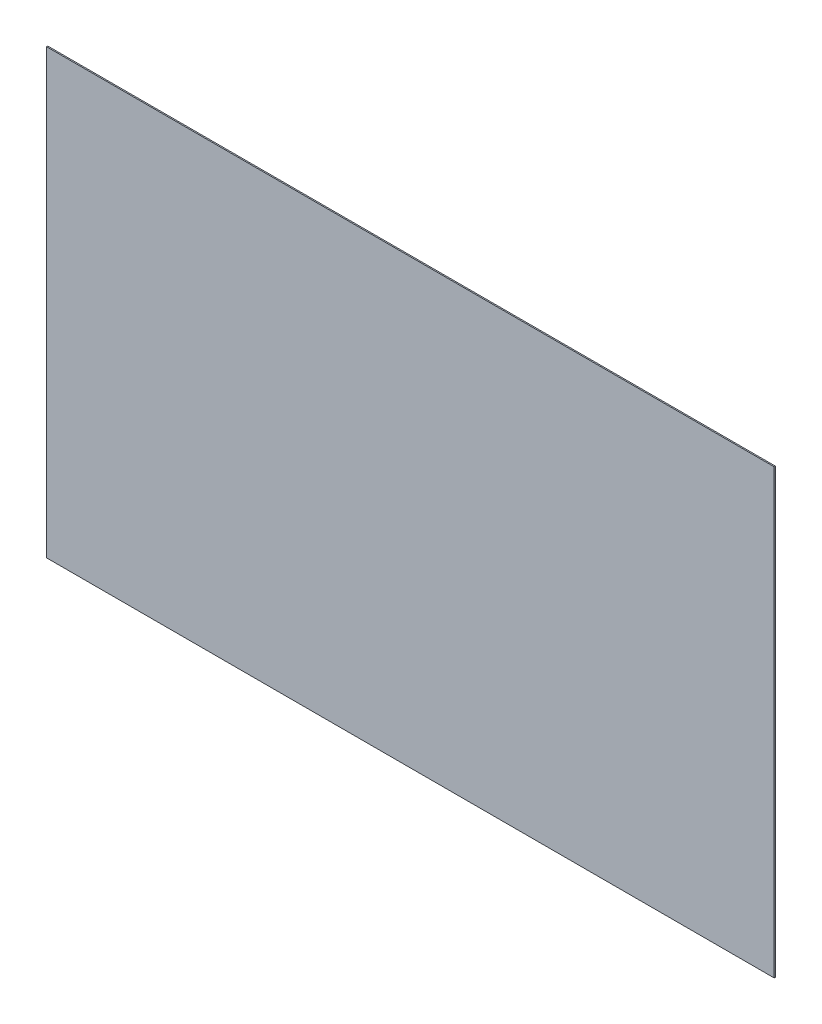
ISO-10303-21;
HEADER;
FILE_DESCRIPTION(('STEP AP214'),'2;1');
FILE_NAME('part.step','',(''),(''),'','','');
FILE_SCHEMA(('AUTOMOTIVE_DESIGN { 1 0 10303 214 1 1 1 1 }'));
ENDSEC;
DATA;
#1=APPLICATION_CONTEXT('core data for automotive mechanical design processes');
#2=APPLICATION_PROTOCOL_DEFINITION('international standard','automotive_design',2000,#1);
#3=PRODUCT_CONTEXT('',#1,'mechanical');
#4=PRODUCT('Part','Part','',(#3));
#5=PRODUCT_RELATED_PRODUCT_CATEGORY('part','',(#4));
#6=PRODUCT_DEFINITION_FORMATION('','',#4);
#7=PRODUCT_DEFINITION_CONTEXT('part definition',#1,'design');
#8=PRODUCT_DEFINITION('design','',#6,#7);
#9=PRODUCT_DEFINITION_SHAPE('','',#8);
#10=(LENGTH_UNIT() NAMED_UNIT(*) SI_UNIT(.MILLI.,.METRE.));
#11=(NAMED_UNIT(*) PLANE_ANGLE_UNIT() SI_UNIT($,.RADIAN.));
#12=(NAMED_UNIT(*) SI_UNIT($,.STERADIAN.) SOLID_ANGLE_UNIT());
#13=UNCERTAINTY_MEASURE_WITH_UNIT(LENGTH_MEASURE(1.E-05),#10,'distance_accuracy_value','');
#14=(GEOMETRIC_REPRESENTATION_CONTEXT(3) GLOBAL_UNCERTAINTY_ASSIGNED_CONTEXT((#13)) GLOBAL_UNIT_ASSIGNED_CONTEXT((#10,
#11,#12)) REPRESENTATION_CONTEXT('',''));
#15=CARTESIAN_POINT('',(0.,0.,0.));
#16=DIRECTION('',(0.,0.,1.));
#17=DIRECTION('',(1.,0.,0.));
#18=AXIS2_PLACEMENT_3D('',#15,#16,#17);
#19=CARTESIAN_POINT('',(3000.,1825.,10.));
#20=DIRECTION('',(-1.,0.,0.));
#21=DIRECTION('',(0.,-1.,0.));
#22=AXIS2_PLACEMENT_3D('',#19,#20,#21);
#23=PLANE('',#22);
#24=DIRECTION('',(0.,1.,0.));
#25=VECTOR('',#24,1.);
#26=CARTESIAN_POINT('',(3000.,1825.,0.));
#27=LINE('',#26,#25);
#28=CARTESIAN_POINT('',(3000.,-1825.,0.));
#29=VERTEX_POINT('',#28);
#30=CARTESIAN_POINT('',(3000.,1825.,0.));
#31=VERTEX_POINT('',#30);
#32=EDGE_CURVE('E111',#29,#31,#27,.T.);
#33=ORIENTED_EDGE('',*,*,#32,.T.);
#34=DIRECTION('',(0.,0.,-1.));
#35=VECTOR('',#34,1.);
#36=CARTESIAN_POINT('',(3000.,1825.,10.));
#37=LINE('',#36,#35);
#38=CARTESIAN_POINT('',(3000.,1825.,10.));
#39=VERTEX_POINT('',#38);
#40=EDGE_CURVE('E11',#39,#31,#37,.T.);
#41=ORIENTED_EDGE('',*,*,#40,.F.);
#42=DIRECTION('',(0.,1.,0.));
#43=VECTOR('',#42,1.);
#44=CARTESIAN_POINT('',(3000.,1825.,10.));
#45=LINE('',#44,#43);
#46=CARTESIAN_POINT('',(3000.,-1825.,10.));
#47=VERTEX_POINT('',#46);
#48=EDGE_CURVE('E95',#47,#39,#45,.T.);
#49=ORIENTED_EDGE('',*,*,#48,.F.);
#50=DIRECTION('',(0.,0.,-1.));
#51=VECTOR('',#50,1.);
#52=CARTESIAN_POINT('',(3000.,-1825.,10.));
#53=LINE('',#52,#51);
#54=EDGE_CURVE('E107',#47,#29,#53,.T.);
#55=ORIENTED_EDGE('',*,*,#54,.T.);
#56=EDGE_LOOP('',(#33,#41,#49,#55));
#57=FACE_BOUND('',#56,.T.);
#58=ADVANCED_FACE('F43',(#57),#23,.F.);
#59=CARTESIAN_POINT('',(-3000.,1825.,10.));
#60=DIRECTION('',(0.,-1.,0.));
#61=DIRECTION('',(1.,0.,0.));
#62=AXIS2_PLACEMENT_3D('',#59,#60,#61);
#63=PLANE('',#62);
#64=DIRECTION('',(-1.,0.,0.));
#65=VECTOR('',#64,1.);
#66=CARTESIAN_POINT('',(-3000.,1825.,0.));
#67=LINE('',#66,#65);
#68=CARTESIAN_POINT('',(-3000.,1825.,0.));
#69=VERTEX_POINT('',#68);
#70=EDGE_CURVE('E100',#31,#69,#67,.T.);
#71=ORIENTED_EDGE('',*,*,#70,.T.);
#72=DIRECTION('',(0.,0.,-1.));
#73=VECTOR('',#72,1.);
#74=CARTESIAN_POINT('',(-3000.,1825.,10.));
#75=LINE('',#74,#73);
#76=CARTESIAN_POINT('',(-3000.,1825.,10.));
#77=VERTEX_POINT('',#76);
#78=EDGE_CURVE('E52',#77,#69,#75,.T.);
#79=ORIENTED_EDGE('',*,*,#78,.F.);
#80=DIRECTION('',(-1.,0.,0.));
#81=VECTOR('',#80,1.);
#82=CARTESIAN_POINT('',(-3000.,1825.,10.));
#83=LINE('',#82,#81);
#84=EDGE_CURVE('E90',#39,#77,#83,.T.);
#85=ORIENTED_EDGE('',*,*,#84,.F.);
#86=ORIENTED_EDGE('',*,*,#40,.T.);
#87=EDGE_LOOP('',(#71,#79,#85,#86));
#88=FACE_BOUND('',#87,.T.);
#89=ADVANCED_FACE('F99',(#88),#63,.F.);
#90=CARTESIAN_POINT('',(-3000.,1825.,10.));
#91=DIRECTION('',(1.,0.,0.));
#92=DIRECTION('',(0.,1.,0.));
#93=AXIS2_PLACEMENT_3D('',#90,#91,#92);
#94=PLANE('',#93);
#95=DIRECTION('',(0.,-1.,0.));
#96=VECTOR('',#95,1.);
#97=CARTESIAN_POINT('',(-3000.,1825.,0.));
#98=LINE('',#97,#96);
#99=CARTESIAN_POINT('',(-3000.,-1825.,0.));
#100=VERTEX_POINT('',#99);
#101=EDGE_CURVE('E77',#69,#100,#98,.T.);
#102=ORIENTED_EDGE('',*,*,#101,.T.);
#103=DIRECTION('',(0.,0.,-1.));
#104=VECTOR('',#103,1.);
#105=CARTESIAN_POINT('',(-3000.,-1825.,10.));
#106=LINE('',#105,#104);
#107=CARTESIAN_POINT('',(-3000.,-1825.,10.));
#108=VERTEX_POINT('',#107);
#109=EDGE_CURVE('E102',#108,#100,#106,.T.);
#110=ORIENTED_EDGE('',*,*,#109,.F.);
#111=DIRECTION('',(0.,-1.,0.));
#112=VECTOR('',#111,1.);
#113=CARTESIAN_POINT('',(-3000.,1825.,10.));
#114=LINE('',#113,#112);
#115=EDGE_CURVE('E93',#77,#108,#114,.T.);
#116=ORIENTED_EDGE('',*,*,#115,.F.);
#117=ORIENTED_EDGE('',*,*,#78,.T.);
#118=EDGE_LOOP('',(#102,#110,#116,#117));
#119=FACE_BOUND('',#118,.T.);
#120=ADVANCED_FACE('F103',(#119),#94,.F.);
#121=CARTESIAN_POINT('',(-3000.,-1825.,10.));
#122=DIRECTION('',(0.,1.,0.));
#123=DIRECTION('',(0.,0.,1.));
#124=AXIS2_PLACEMENT_3D('',#121,#122,#123);
#125=PLANE('',#124);
#126=DIRECTION('',(1.,0.,0.));
#127=VECTOR('',#126,1.);
#128=CARTESIAN_POINT('',(-3000.,-1825.,0.));
#129=LINE('',#128,#127);
#130=EDGE_CURVE('E83',#100,#29,#129,.T.);
#131=ORIENTED_EDGE('',*,*,#130,.T.);
#132=ORIENTED_EDGE('',*,*,#54,.F.);
#133=DIRECTION('',(1.,0.,0.));
#134=VECTOR('',#133,1.);
#135=CARTESIAN_POINT('',(-3000.,-1825.,10.));
#136=LINE('',#135,#134);
#137=EDGE_CURVE('E60',#108,#47,#136,.T.);
#138=ORIENTED_EDGE('',*,*,#137,.F.);
#139=ORIENTED_EDGE('',*,*,#109,.T.);
#140=EDGE_LOOP('',(#131,#132,#138,#139));
#141=FACE_BOUND('',#140,.T.);
#142=ADVANCED_FACE('F124',(#141),#125,.F.);
#143=CARTESIAN_POINT('',(0.,0.,10.));
#144=DIRECTION('',(0.,0.,1.));
#145=DIRECTION('',(1.,0.,0.));
#146=AXIS2_PLACEMENT_3D('',#143,#144,#145);
#147=PLANE('',#146);
#148=ORIENTED_EDGE('',*,*,#48,.T.);
#149=ORIENTED_EDGE('',*,*,#84,.T.);
#150=ORIENTED_EDGE('',*,*,#115,.T.);
#151=ORIENTED_EDGE('',*,*,#137,.T.);
#152=EDGE_LOOP('',(#148,#149,#150,#151));
#153=FACE_BOUND('',#152,.T.);
#154=ADVANCED_FACE('F91',(#153),#147,.T.);
#155=CARTESIAN_POINT('',(0.,0.,0.));
#156=DIRECTION('',(0.,0.,1.));
#157=DIRECTION('',(1.,0.,0.));
#158=AXIS2_PLACEMENT_3D('',#155,#156,#157);
#159=PLANE('',#158);
#160=ORIENTED_EDGE('',*,*,#32,.F.);
#161=ORIENTED_EDGE('',*,*,#130,.F.);
#162=ORIENTED_EDGE('',*,*,#101,.F.);
#163=ORIENTED_EDGE('',*,*,#70,.F.);
#164=EDGE_LOOP('',(#160,#161,#162,#163));
#165=FACE_BOUND('',#164,.T.);
#166=ADVANCED_FACE('F127',(#165),#159,.F.);
#167=CLOSED_SHELL('',(#58,#89,#120,#142,#154,#166));
#168=MANIFOLD_SOLID_BREP('B2',#167);
#169=ADVANCED_BREP_SHAPE_REPRESENTATION('',(#18,#168),#14);
#170=SHAPE_DEFINITION_REPRESENTATION(#9,#169);
ENDSEC;
END-ISO-10303-21;
